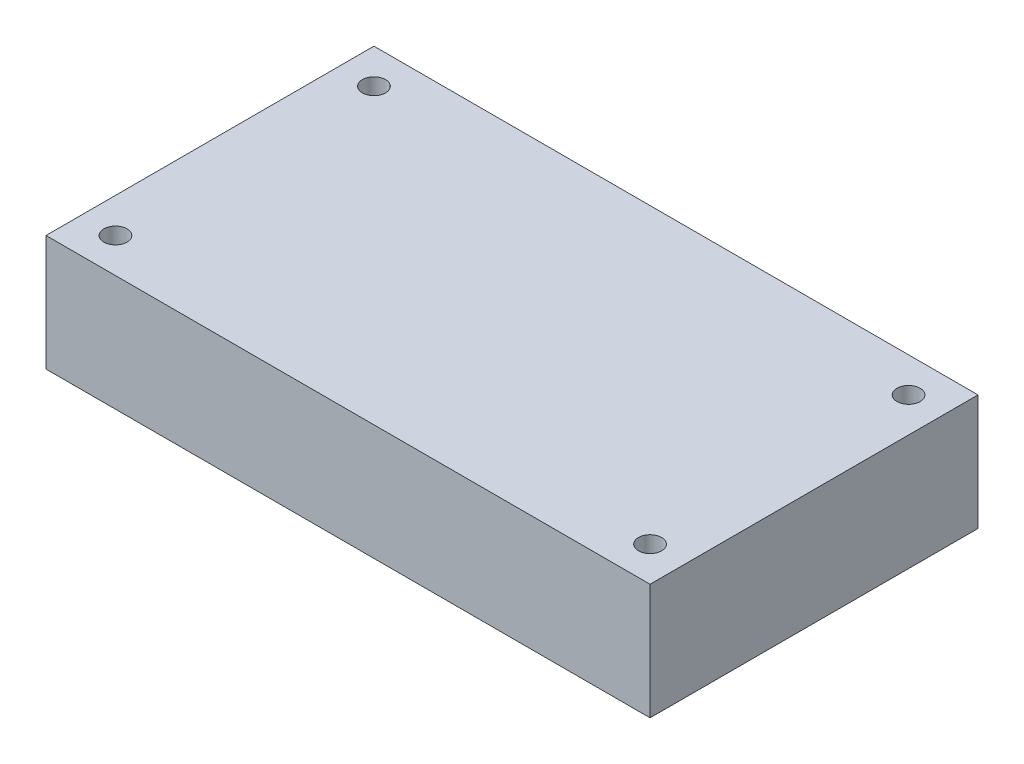
ISO-10303-21;
HEADER;
FILE_DESCRIPTION(('STEP AP214'),'2;1');
FILE_NAME('part.step','',(''),(''),'','','');
FILE_SCHEMA(('AUTOMOTIVE_DESIGN { 1 0 10303 214 1 1 1 1 }'));
ENDSEC;
DATA;
#1=APPLICATION_CONTEXT('core data for automotive mechanical design processes');
#2=APPLICATION_PROTOCOL_DEFINITION('international standard','automotive_design',2000,#1);
#3=PRODUCT_CONTEXT('',#1,'mechanical');
#4=PRODUCT('Part','Part','',(#3));
#5=PRODUCT_RELATED_PRODUCT_CATEGORY('part','',(#4));
#6=PRODUCT_DEFINITION_FORMATION('','',#4);
#7=PRODUCT_DEFINITION_CONTEXT('part definition',#1,'design');
#8=PRODUCT_DEFINITION('design','',#6,#7);
#9=PRODUCT_DEFINITION_SHAPE('','',#8);
#10=(LENGTH_UNIT() NAMED_UNIT(*) SI_UNIT(.MILLI.,.METRE.));
#11=(NAMED_UNIT(*) PLANE_ANGLE_UNIT() SI_UNIT($,.RADIAN.));
#12=(NAMED_UNIT(*) SI_UNIT($,.STERADIAN.) SOLID_ANGLE_UNIT());
#13=UNCERTAINTY_MEASURE_WITH_UNIT(LENGTH_MEASURE(1.E-05),#10,'distance_accuracy_value','');
#14=(GEOMETRIC_REPRESENTATION_CONTEXT(3) GLOBAL_UNCERTAINTY_ASSIGNED_CONTEXT((#13)) GLOBAL_UNIT_ASSIGNED_CONTEXT((#10,
#11,#12)) REPRESENTATION_CONTEXT('',''));
#15=CARTESIAN_POINT('',(0.,0.,0.));
#16=DIRECTION('',(0.,0.,1.));
#17=DIRECTION('',(1.,0.,0.));
#18=AXIS2_PLACEMENT_3D('',#15,#16,#17);
#19=CARTESIAN_POINT('',(0.,12.7,0.));
#20=DIRECTION('',(0.,-1.,0.));
#21=DIRECTION('',(0.,0.,-1.));
#22=AXIS2_PLACEMENT_3D('',#19,#20,#21);
#23=PLANE('',#22);
#24=DIRECTION('',(0.,0.,-1.));
#25=VECTOR('',#24,1.);
#26=CARTESIAN_POINT('',(33.147,12.7,17.9959));
#27=LINE('',#26,#25);
#28=CARTESIAN_POINT('',(33.147,12.7,17.9959));
#29=VERTEX_POINT('',#28);
#30=CARTESIAN_POINT('',(33.147,12.7,-17.9959));
#31=VERTEX_POINT('',#30);
#32=EDGE_CURVE('E89',#29,#31,#27,.T.);
#33=ORIENTED_EDGE('',*,*,#32,.T.);
#34=DIRECTION('',(-1.,0.,0.));
#35=VECTOR('',#34,1.);
#36=CARTESIAN_POINT('',(-33.147,12.7,-17.9959));
#37=LINE('',#36,#35);
#38=CARTESIAN_POINT('',(-33.147,12.7,-17.9959));
#39=VERTEX_POINT('',#38);
#40=EDGE_CURVE('E84',#31,#39,#37,.T.);
#41=ORIENTED_EDGE('',*,*,#40,.T.);
#42=DIRECTION('',(0.,0.,1.));
#43=VECTOR('',#42,1.);
#44=CARTESIAN_POINT('',(-33.147,12.7,17.9959));
#45=LINE('',#44,#43);
#46=CARTESIAN_POINT('',(-33.147,12.7,17.9959));
#47=VERTEX_POINT('',#46);
#48=EDGE_CURVE('E87',#39,#47,#45,.T.);
#49=ORIENTED_EDGE('',*,*,#48,.T.);
#50=DIRECTION('',(1.,0.,0.));
#51=VECTOR('',#50,1.);
#52=CARTESIAN_POINT('',(-33.147,12.7,17.9959));
#53=LINE('',#52,#51);
#54=EDGE_CURVE('E54',#47,#29,#53,.T.);
#55=ORIENTED_EDGE('',*,*,#54,.T.);
#56=EDGE_LOOP('',(#33,#41,#49,#55));
#57=FACE_BOUND('',#56,.T.);
#58=CARTESIAN_POINT('',(-29.337,12.7,-14.1859));
#59=DIRECTION('',(0.,1.,0.));
#60=DIRECTION('',(0.,0.,1.));
#61=AXIS2_PLACEMENT_3D('',#58,#59,#60);
#62=CIRCLE('',#61,1.27);
#63=CARTESIAN_POINT('',(-29.337,12.7,-12.9159));
#64=VERTEX_POINT('',#63);
#65=EDGE_CURVE('E104',#64,#64,#62,.T.);
#66=ORIENTED_EDGE('',*,*,#65,.F.);
#67=EDGE_LOOP('',(#66));
#68=FACE_BOUND('',#67,.T.);
#69=CARTESIAN_POINT('',(29.337,12.7,-14.1859));
#70=DIRECTION('',(0.,1.,0.));
#71=DIRECTION('',(0.,0.,-1.));
#72=AXIS2_PLACEMENT_3D('',#69,#70,#71);
#73=CIRCLE('',#72,1.27);
#74=CARTESIAN_POINT('',(29.337,12.7,-15.4559));
#75=VERTEX_POINT('',#74);
#76=EDGE_CURVE('E119',#75,#75,#73,.T.);
#77=ORIENTED_EDGE('',*,*,#76,.F.);
#78=EDGE_LOOP('',(#77));
#79=FACE_BOUND('',#78,.T.);
#80=CARTESIAN_POINT('',(29.337,12.7,14.1859));
#81=DIRECTION('',(0.,1.,0.));
#82=DIRECTION('',(0.,0.,1.));
#83=AXIS2_PLACEMENT_3D('',#80,#81,#82);
#84=CIRCLE('',#83,1.27);
#85=CARTESIAN_POINT('',(29.337,12.7,15.4559));
#86=VERTEX_POINT('',#85);
#87=EDGE_CURVE('E125',#86,#86,#84,.T.);
#88=ORIENTED_EDGE('',*,*,#87,.F.);
#89=EDGE_LOOP('',(#88));
#90=FACE_BOUND('',#89,.T.);
#91=CARTESIAN_POINT('',(-29.337,12.7,14.1859));
#92=DIRECTION('',(0.,1.,0.));
#93=DIRECTION('',(0.,0.,-1.));
#94=AXIS2_PLACEMENT_3D('',#91,#92,#93);
#95=CIRCLE('',#94,1.27);
#96=CARTESIAN_POINT('',(-29.337,12.7,12.9159));
#97=VERTEX_POINT('',#96);
#98=EDGE_CURVE('E131',#97,#97,#95,.T.);
#99=ORIENTED_EDGE('',*,*,#98,.F.);
#100=EDGE_LOOP('',(#99));
#101=FACE_BOUND('',#100,.T.);
#102=ADVANCED_FACE('F37',(#57,#68,#79,#90,#101),#23,.F.);
#103=CARTESIAN_POINT('',(0.,0.,0.));
#104=DIRECTION('',(0.,-1.,0.));
#105=DIRECTION('',(0.,0.,-1.));
#106=AXIS2_PLACEMENT_3D('',#103,#104,#105);
#107=PLANE('',#106);
#108=CARTESIAN_POINT('',(29.337,0.,14.1859));
#109=DIRECTION('',(0.,1.,0.));
#110=DIRECTION('',(0.,0.,1.));
#111=AXIS2_PLACEMENT_3D('',#108,#109,#110);
#112=CIRCLE('',#111,1.27);
#113=CARTESIAN_POINT('',(29.337,0.,15.4559));
#114=VERTEX_POINT('',#113);
#115=EDGE_CURVE('E128',#114,#114,#112,.T.);
#116=ORIENTED_EDGE('',*,*,#115,.T.);
#117=EDGE_LOOP('',(#116));
#118=FACE_BOUND('',#117,.T.);
#119=CARTESIAN_POINT('',(-29.337,0.,-14.1859));
#120=DIRECTION('',(0.,1.,0.));
#121=DIRECTION('',(0.,0.,1.));
#122=AXIS2_PLACEMENT_3D('',#119,#120,#121);
#123=CIRCLE('',#122,1.27);
#124=CARTESIAN_POINT('',(-29.337,0.,-12.9159));
#125=VERTEX_POINT('',#124);
#126=EDGE_CURVE('E116',#125,#125,#123,.T.);
#127=ORIENTED_EDGE('',*,*,#126,.T.);
#128=EDGE_LOOP('',(#127));
#129=FACE_BOUND('',#128,.T.);
#130=DIRECTION('',(0.,0.,-1.));
#131=VECTOR('',#130,1.);
#132=CARTESIAN_POINT('',(33.147,0.,17.9959));
#133=LINE('',#132,#131);
#134=CARTESIAN_POINT('',(33.147,0.,17.9959));
#135=VERTEX_POINT('',#134);
#136=CARTESIAN_POINT('',(33.147,0.,-17.9959));
#137=VERTEX_POINT('',#136);
#138=EDGE_CURVE('E101',#135,#137,#133,.T.);
#139=ORIENTED_EDGE('',*,*,#138,.F.);
#140=DIRECTION('',(1.,0.,0.));
#141=VECTOR('',#140,1.);
#142=CARTESIAN_POINT('',(-33.147,0.,17.9959));
#143=LINE('',#142,#141);
#144=CARTESIAN_POINT('',(-33.147,0.,17.9959));
#145=VERTEX_POINT('',#144);
#146=EDGE_CURVE('E77',#145,#135,#143,.T.);
#147=ORIENTED_EDGE('',*,*,#146,.F.);
#148=DIRECTION('',(0.,0.,1.));
#149=VECTOR('',#148,1.);
#150=CARTESIAN_POINT('',(-33.147,0.,17.9959));
#151=LINE('',#150,#149);
#152=CARTESIAN_POINT('',(-33.147,0.,-17.9959));
#153=VERTEX_POINT('',#152);
#154=EDGE_CURVE('E71',#153,#145,#151,.T.);
#155=ORIENTED_EDGE('',*,*,#154,.F.);
#156=DIRECTION('',(-1.,0.,0.));
#157=VECTOR('',#156,1.);
#158=CARTESIAN_POINT('',(-33.147,0.,-17.9959));
#159=LINE('',#158,#157);
#160=EDGE_CURVE('E93',#137,#153,#159,.T.);
#161=ORIENTED_EDGE('',*,*,#160,.F.);
#162=EDGE_LOOP('',(#139,#147,#155,#161));
#163=FACE_BOUND('',#162,.T.);
#164=CARTESIAN_POINT('',(29.337,0.,-14.1859));
#165=DIRECTION('',(0.,1.,0.));
#166=DIRECTION('',(0.,0.,-1.));
#167=AXIS2_PLACEMENT_3D('',#164,#165,#166);
#168=CIRCLE('',#167,1.27);
#169=CARTESIAN_POINT('',(29.337,0.,-15.4559));
#170=VERTEX_POINT('',#169);
#171=EDGE_CURVE('E122',#170,#170,#168,.T.);
#172=ORIENTED_EDGE('',*,*,#171,.T.);
#173=EDGE_LOOP('',(#172));
#174=FACE_BOUND('',#173,.T.);
#175=CARTESIAN_POINT('',(-29.337,0.,14.1859));
#176=DIRECTION('',(0.,1.,0.));
#177=DIRECTION('',(0.,0.,-1.));
#178=AXIS2_PLACEMENT_3D('',#175,#176,#177);
#179=CIRCLE('',#178,1.27);
#180=CARTESIAN_POINT('',(-29.337,0.,12.9159));
#181=VERTEX_POINT('',#180);
#182=EDGE_CURVE('E134',#181,#181,#179,.T.);
#183=ORIENTED_EDGE('',*,*,#182,.T.);
#184=EDGE_LOOP('',(#183));
#185=FACE_BOUND('',#184,.T.);
#186=ADVANCED_FACE('F112',(#118,#129,#163,#174,#185),#107,.T.);
#187=CARTESIAN_POINT('',(33.147,12.7,17.9959));
#188=DIRECTION('',(-1.,0.,0.));
#189=DIRECTION('',(0.,0.,1.));
#190=AXIS2_PLACEMENT_3D('',#187,#188,#189);
#191=PLANE('',#190);
#192=ORIENTED_EDGE('',*,*,#138,.T.);
#193=DIRECTION('',(0.,-1.,0.));
#194=VECTOR('',#193,1.);
#195=CARTESIAN_POINT('',(33.147,12.7,-17.9959));
#196=LINE('',#195,#194);
#197=EDGE_CURVE('E11',#31,#137,#196,.T.);
#198=ORIENTED_EDGE('',*,*,#197,.F.);
#199=ORIENTED_EDGE('',*,*,#32,.F.);
#200=DIRECTION('',(0.,-1.,0.));
#201=VECTOR('',#200,1.);
#202=CARTESIAN_POINT('',(33.147,12.7,17.9959));
#203=LINE('',#202,#201);
#204=EDGE_CURVE('E97',#29,#135,#203,.T.);
#205=ORIENTED_EDGE('',*,*,#204,.T.);
#206=EDGE_LOOP('',(#192,#198,#199,#205));
#207=FACE_BOUND('',#206,.T.);
#208=ADVANCED_FACE('F39',(#207),#191,.F.);
#209=CARTESIAN_POINT('',(-33.147,12.7,-17.9959));
#210=DIRECTION('',(0.,0.,1.));
#211=DIRECTION('',(1.,0.,0.));
#212=AXIS2_PLACEMENT_3D('',#209,#210,#211);
#213=PLANE('',#212);
#214=ORIENTED_EDGE('',*,*,#160,.T.);
#215=DIRECTION('',(0.,-1.,0.));
#216=VECTOR('',#215,1.);
#217=CARTESIAN_POINT('',(-33.147,12.7,-17.9959));
#218=LINE('',#217,#216);
#219=EDGE_CURVE('E46',#39,#153,#218,.T.);
#220=ORIENTED_EDGE('',*,*,#219,.F.);
#221=ORIENTED_EDGE('',*,*,#40,.F.);
#222=ORIENTED_EDGE('',*,*,#197,.T.);
#223=EDGE_LOOP('',(#214,#220,#221,#222));
#224=FACE_BOUND('',#223,.T.);
#225=ADVANCED_FACE('F92',(#224),#213,.F.);
#226=CARTESIAN_POINT('',(-33.147,12.7,17.9959));
#227=DIRECTION('',(1.,0.,0.));
#228=DIRECTION('',(0.,0.,-1.));
#229=AXIS2_PLACEMENT_3D('',#226,#227,#228);
#230=PLANE('',#229);
#231=ORIENTED_EDGE('',*,*,#154,.T.);
#232=DIRECTION('',(0.,-1.,0.));
#233=VECTOR('',#232,1.);
#234=CARTESIAN_POINT('',(-33.147,12.7,17.9959));
#235=LINE('',#234,#233);
#236=EDGE_CURVE('E94',#47,#145,#235,.T.);
#237=ORIENTED_EDGE('',*,*,#236,.F.);
#238=ORIENTED_EDGE('',*,*,#48,.F.);
#239=ORIENTED_EDGE('',*,*,#219,.T.);
#240=EDGE_LOOP('',(#231,#237,#238,#239));
#241=FACE_BOUND('',#240,.T.);
#242=ADVANCED_FACE('F95',(#241),#230,.F.);
#243=CARTESIAN_POINT('',(-33.147,12.7,17.9959));
#244=DIRECTION('',(0.,0.,-1.));
#245=DIRECTION('',(-1.,0.,0.));
#246=AXIS2_PLACEMENT_3D('',#243,#244,#245);
#247=PLANE('',#246);
#248=ORIENTED_EDGE('',*,*,#146,.T.);
#249=ORIENTED_EDGE('',*,*,#204,.F.);
#250=ORIENTED_EDGE('',*,*,#54,.F.);
#251=ORIENTED_EDGE('',*,*,#236,.T.);
#252=EDGE_LOOP('',(#248,#249,#250,#251));
#253=FACE_BOUND('',#252,.T.);
#254=ADVANCED_FACE('F109',(#253),#247,.F.);
#255=CARTESIAN_POINT('',(-29.337,12.7,-14.1859));
#256=DIRECTION('',(0.,-1.,0.));
#257=DIRECTION('',(0.,0.,-1.));
#258=AXIS2_PLACEMENT_3D('',#255,#256,#257);
#259=CYLINDRICAL_SURFACE('',#258,1.27);
#260=ORIENTED_EDGE('',*,*,#65,.T.);
#261=EDGE_LOOP('',(#260));
#262=FACE_BOUND('',#261,.T.);
#263=ORIENTED_EDGE('',*,*,#126,.F.);
#264=EDGE_LOOP('',(#263));
#265=FACE_BOUND('',#264,.T.);
#266=ADVANCED_FACE('F151',(#262,#265),#259,.F.);
#267=CARTESIAN_POINT('',(29.337,12.7,-14.1859));
#268=DIRECTION('',(0.,-1.,0.));
#269=DIRECTION('',(0.,0.,-1.));
#270=AXIS2_PLACEMENT_3D('',#267,#268,#269);
#271=CYLINDRICAL_SURFACE('',#270,1.27);
#272=ORIENTED_EDGE('',*,*,#76,.T.);
#273=EDGE_LOOP('',(#272));
#274=FACE_BOUND('',#273,.T.);
#275=ORIENTED_EDGE('',*,*,#171,.F.);
#276=EDGE_LOOP('',(#275));
#277=FACE_BOUND('',#276,.T.);
#278=ADVANCED_FACE('F205',(#274,#277),#271,.F.);
#279=CARTESIAN_POINT('',(29.337,12.7,14.1859));
#280=DIRECTION('',(0.,-1.,0.));
#281=DIRECTION('',(0.,0.,-1.));
#282=AXIS2_PLACEMENT_3D('',#279,#280,#281);
#283=CYLINDRICAL_SURFACE('',#282,1.27);
#284=ORIENTED_EDGE('',*,*,#87,.T.);
#285=EDGE_LOOP('',(#284));
#286=FACE_BOUND('',#285,.T.);
#287=ORIENTED_EDGE('',*,*,#115,.F.);
#288=EDGE_LOOP('',(#287));
#289=FACE_BOUND('',#288,.T.);
#290=ADVANCED_FACE('F214',(#286,#289),#283,.F.);
#291=CARTESIAN_POINT('',(-29.337,12.7,14.1859));
#292=DIRECTION('',(0.,-1.,0.));
#293=DIRECTION('',(0.,0.,-1.));
#294=AXIS2_PLACEMENT_3D('',#291,#292,#293);
#295=CYLINDRICAL_SURFACE('',#294,1.27);
#296=ORIENTED_EDGE('',*,*,#98,.T.);
#297=EDGE_LOOP('',(#296));
#298=FACE_BOUND('',#297,.T.);
#299=ORIENTED_EDGE('',*,*,#182,.F.);
#300=EDGE_LOOP('',(#299));
#301=FACE_BOUND('',#300,.T.);
#302=ADVANCED_FACE('F140',(#298,#301),#295,.F.);
#303=CLOSED_SHELL('',(#102,#186,#208,#225,#242,#254,#266,#278,#290,#302));
#304=MANIFOLD_SOLID_BREP('B2',#303);
#305=ADVANCED_BREP_SHAPE_REPRESENTATION('',(#18,#304),#14);
#306=SHAPE_DEFINITION_REPRESENTATION(#9,#305);
ENDSEC;
END-ISO-10303-21;
